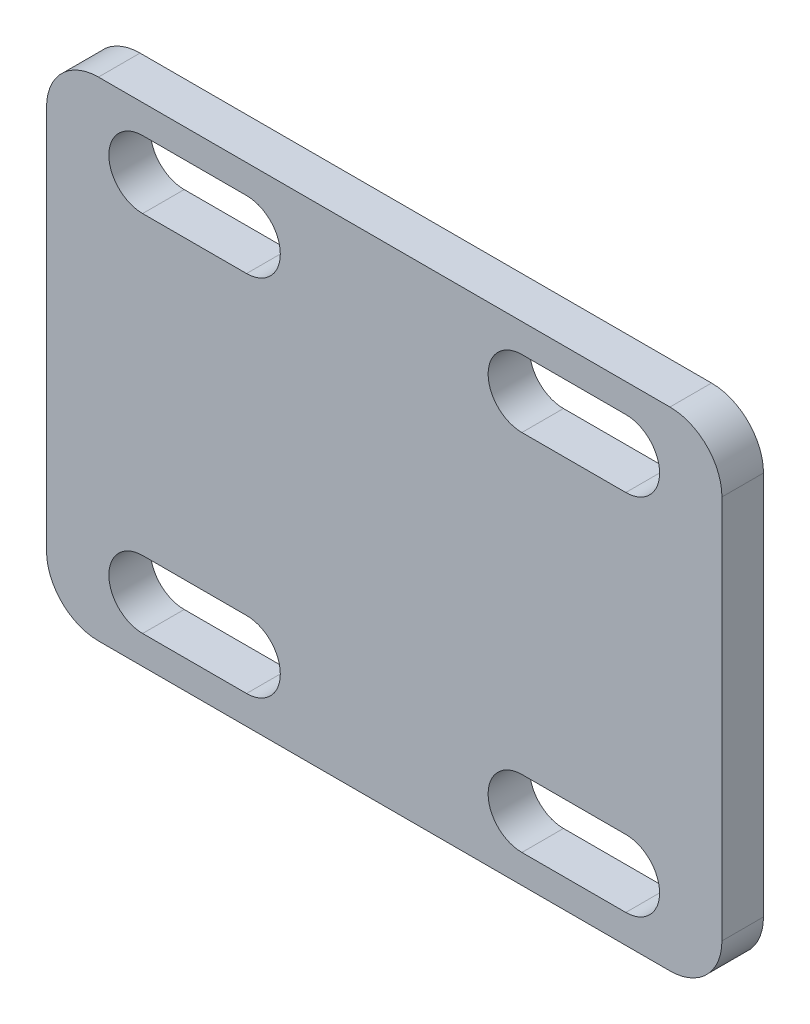
ISO-10303-21;
HEADER;
FILE_DESCRIPTION(('STEP AP214'),'2;1');
FILE_NAME('part.step','',(''),(''),'','','');
FILE_SCHEMA(('AUTOMOTIVE_DESIGN { 1 0 10303 214 1 1 1 1 }'));
ENDSEC;
DATA;
#1=APPLICATION_CONTEXT('core data for automotive mechanical design processes');
#2=APPLICATION_PROTOCOL_DEFINITION('international standard','automotive_design',2000,#1);
#3=PRODUCT_CONTEXT('',#1,'mechanical');
#4=PRODUCT('Part','Part','',(#3));
#5=PRODUCT_RELATED_PRODUCT_CATEGORY('part','',(#4));
#6=PRODUCT_DEFINITION_FORMATION('','',#4);
#7=PRODUCT_DEFINITION_CONTEXT('part definition',#1,'design');
#8=PRODUCT_DEFINITION('design','',#6,#7);
#9=PRODUCT_DEFINITION_SHAPE('','',#8);
#10=(LENGTH_UNIT() NAMED_UNIT(*) SI_UNIT(.MILLI.,.METRE.));
#11=(NAMED_UNIT(*) PLANE_ANGLE_UNIT() SI_UNIT($,.RADIAN.));
#12=(NAMED_UNIT(*) SI_UNIT($,.STERADIAN.) SOLID_ANGLE_UNIT());
#13=UNCERTAINTY_MEASURE_WITH_UNIT(LENGTH_MEASURE(1.E-05),#10,'distance_accuracy_value','');
#14=(GEOMETRIC_REPRESENTATION_CONTEXT(3) GLOBAL_UNCERTAINTY_ASSIGNED_CONTEXT((#13)) GLOBAL_UNIT_ASSIGNED_CONTEXT((#10,
#11,#12)) REPRESENTATION_CONTEXT('',''));
#15=CARTESIAN_POINT('',(0.,0.,0.));
#16=DIRECTION('',(0.,0.,1.));
#17=DIRECTION('',(1.,0.,0.));
#18=AXIS2_PLACEMENT_3D('',#15,#16,#17);
#19=CARTESIAN_POINT('',(0.,0.,8.));
#20=DIRECTION('',(0.,0.,-1.));
#21=DIRECTION('',(-1.,0.,0.));
#22=AXIS2_PLACEMENT_3D('',#19,#20,#21);
#23=PLANE('',#22);
#24=DIRECTION('',(1.,0.,0.));
#25=VECTOR('',#24,1.);
#26=CARTESIAN_POINT('',(-65.,-47.,8.));
#27=LINE('',#26,#25);
#28=CARTESIAN_POINT('',(-55.,-47.,8.));
#29=VERTEX_POINT('',#28);
#30=CARTESIAN_POINT('',(55.,-47.,8.));
#31=VERTEX_POINT('',#30);
#32=EDGE_CURVE('E401',#29,#31,#27,.T.);
#33=ORIENTED_EDGE('',*,*,#32,.T.);
#34=CARTESIAN_POINT('',(55.,-37.,8.));
#35=DIRECTION('',(0.,0.,-1.));
#36=DIRECTION('',(-1.,0.,0.));
#37=AXIS2_PLACEMENT_3D('',#34,#35,#36);
#38=CIRCLE('',#37,10.);
#39=CARTESIAN_POINT('',(65.,-37.,8.));
#40=VERTEX_POINT('',#39);
#41=EDGE_CURVE('E452',#31,#40,#38,.F.);
#42=ORIENTED_EDGE('',*,*,#41,.T.);
#43=DIRECTION('',(0.,1.,0.));
#44=VECTOR('',#43,1.);
#45=CARTESIAN_POINT('',(65.,-47.,8.));
#46=LINE('',#45,#44);
#47=CARTESIAN_POINT('',(65.,37.,8.));
#48=VERTEX_POINT('',#47);
#49=EDGE_CURVE('E390',#40,#48,#46,.T.);
#50=ORIENTED_EDGE('',*,*,#49,.T.);
#51=CARTESIAN_POINT('',(55.,37.,8.));
#52=DIRECTION('',(0.,0.,-1.));
#53=DIRECTION('',(-1.,0.,0.));
#54=AXIS2_PLACEMENT_3D('',#51,#52,#53);
#55=CIRCLE('',#54,10.);
#56=CARTESIAN_POINT('',(55.,47.,8.));
#57=VERTEX_POINT('',#56);
#58=EDGE_CURVE('E447',#48,#57,#55,.F.);
#59=ORIENTED_EDGE('',*,*,#58,.T.);
#60=DIRECTION('',(-1.,0.,0.));
#61=VECTOR('',#60,1.);
#62=CARTESIAN_POINT('',(-65.,47.,8.));
#63=LINE('',#62,#61);
#64=CARTESIAN_POINT('',(-55.,47.,8.));
#65=VERTEX_POINT('',#64);
#66=EDGE_CURVE('E394',#57,#65,#63,.T.);
#67=ORIENTED_EDGE('',*,*,#66,.T.);
#68=CARTESIAN_POINT('',(-55.,37.,8.));
#69=DIRECTION('',(0.,0.,-1.));
#70=DIRECTION('',(-1.,0.,0.));
#71=AXIS2_PLACEMENT_3D('',#68,#69,#70);
#72=CIRCLE('',#71,10.);
#73=CARTESIAN_POINT('',(-65.,37.,8.));
#74=VERTEX_POINT('',#73);
#75=EDGE_CURVE('E61',#65,#74,#72,.F.);
#76=ORIENTED_EDGE('',*,*,#75,.T.);
#77=DIRECTION('',(0.,-1.,0.));
#78=VECTOR('',#77,1.);
#79=CARTESIAN_POINT('',(-65.,-47.,8.));
#80=LINE('',#79,#78);
#81=CARTESIAN_POINT('',(-65.,-37.,8.));
#82=VERTEX_POINT('',#81);
#83=EDGE_CURVE('E398',#74,#82,#80,.T.);
#84=ORIENTED_EDGE('',*,*,#83,.T.);
#85=CARTESIAN_POINT('',(-55.,-37.,8.));
#86=DIRECTION('',(0.,0.,-1.));
#87=DIRECTION('',(-1.,0.,0.));
#88=AXIS2_PLACEMENT_3D('',#85,#86,#87);
#89=CIRCLE('',#88,10.);
#90=EDGE_CURVE('E444',#82,#29,#89,.F.);
#91=ORIENTED_EDGE('',*,*,#90,.T.);
#92=EDGE_LOOP('',(#33,#42,#50,#59,#67,#76,#84,#91));
#93=FACE_BOUND('',#92,.T.);
#94=DIRECTION('',(1.,0.,0.));
#95=VECTOR('',#94,1.);
#96=CARTESIAN_POINT('',(-46.5,28.5,8.));
#97=LINE('',#96,#95);
#98=CARTESIAN_POINT('',(-46.5,28.5,8.));
#99=VERTEX_POINT('',#98);
#100=CARTESIAN_POINT('',(-26.5,28.5,8.));
#101=VERTEX_POINT('',#100);
#102=EDGE_CURVE('E368',#99,#101,#97,.T.);
#103=ORIENTED_EDGE('',*,*,#102,.F.);
#104=CARTESIAN_POINT('',(-46.5,35.,8.));
#105=DIRECTION('',(0.,0.,1.));
#106=DIRECTION('',(1.,0.,0.));
#107=AXIS2_PLACEMENT_3D('',#104,#105,#106);
#108=CIRCLE('',#107,6.5);
#109=CARTESIAN_POINT('',(-46.5,41.5,8.));
#110=VERTEX_POINT('',#109);
#111=EDGE_CURVE('E279',#110,#99,#108,.T.);
#112=ORIENTED_EDGE('',*,*,#111,.F.);
#113=DIRECTION('',(-1.,0.,0.));
#114=VECTOR('',#113,1.);
#115=CARTESIAN_POINT('',(-46.5,41.5,8.));
#116=LINE('',#115,#114);
#117=CARTESIAN_POINT('',(-26.5,41.5,8.));
#118=VERTEX_POINT('',#117);
#119=EDGE_CURVE('E376',#118,#110,#116,.T.);
#120=ORIENTED_EDGE('',*,*,#119,.F.);
#121=CARTESIAN_POINT('',(-26.5,35.,8.));
#122=DIRECTION('',(0.,0.,1.));
#123=DIRECTION('',(1.,0.,0.));
#124=AXIS2_PLACEMENT_3D('',#121,#122,#123);
#125=CIRCLE('',#124,6.5);
#126=EDGE_CURVE('E372',#101,#118,#125,.T.);
#127=ORIENTED_EDGE('',*,*,#126,.F.);
#128=EDGE_LOOP('',(#103,#112,#120,#127));
#129=FACE_BOUND('',#128,.T.);
#130=CARTESIAN_POINT('',(-26.5,-35.,8.));
#131=DIRECTION('',(0.,0.,1.));
#132=DIRECTION('',(1.,0.,0.));
#133=AXIS2_PLACEMENT_3D('',#130,#131,#132);
#134=CIRCLE('',#133,6.5);
#135=CARTESIAN_POINT('',(-26.5,-41.5,8.));
#136=VERTEX_POINT('',#135);
#137=CARTESIAN_POINT('',(-26.5,-28.5,8.));
#138=VERTEX_POINT('',#137);
#139=EDGE_CURVE('E259',#136,#138,#134,.T.);
#140=ORIENTED_EDGE('',*,*,#139,.F.);
#141=DIRECTION('',(1.,0.,0.));
#142=VECTOR('',#141,1.);
#143=CARTESIAN_POINT('',(-46.5,-41.5,8.));
#144=LINE('',#143,#142);
#145=CARTESIAN_POINT('',(-46.5,-41.5,8.));
#146=VERTEX_POINT('',#145);
#147=EDGE_CURVE('E353',#146,#136,#144,.T.);
#148=ORIENTED_EDGE('',*,*,#147,.F.);
#149=CARTESIAN_POINT('',(-46.5,-35.,8.));
#150=DIRECTION('',(0.,0.,1.));
#151=DIRECTION('',(1.,0.,0.));
#152=AXIS2_PLACEMENT_3D('',#149,#150,#151);
#153=CIRCLE('',#152,6.5);
#154=CARTESIAN_POINT('',(-46.5,-28.5,8.));
#155=VERTEX_POINT('',#154);
#156=EDGE_CURVE('E343',#155,#146,#153,.T.);
#157=ORIENTED_EDGE('',*,*,#156,.F.);
#158=DIRECTION('',(-1.,0.,0.));
#159=VECTOR('',#158,1.);
#160=CARTESIAN_POINT('',(-46.5,-28.5,8.));
#161=LINE('',#160,#159);
#162=EDGE_CURVE('E347',#138,#155,#161,.T.);
#163=ORIENTED_EDGE('',*,*,#162,.F.);
#164=EDGE_LOOP('',(#140,#148,#157,#163));
#165=FACE_BOUND('',#164,.T.);
#166=CARTESIAN_POINT('',(46.5,-35.,8.));
#167=DIRECTION('',(0.,0.,1.));
#168=DIRECTION('',(1.,0.,0.));
#169=AXIS2_PLACEMENT_3D('',#166,#167,#168);
#170=CIRCLE('',#169,6.5);
#171=CARTESIAN_POINT('',(46.5,-41.5,8.));
#172=VERTEX_POINT('',#171);
#173=CARTESIAN_POINT('',(46.5,-28.5,8.));
#174=VERTEX_POINT('',#173);
#175=EDGE_CURVE('E243',#172,#174,#170,.T.);
#176=ORIENTED_EDGE('',*,*,#175,.F.);
#177=DIRECTION('',(1.,0.,0.));
#178=VECTOR('',#177,1.);
#179=CARTESIAN_POINT('',(26.5,-41.5,8.));
#180=LINE('',#179,#178);
#181=CARTESIAN_POINT('',(26.5,-41.5,8.));
#182=VERTEX_POINT('',#181);
#183=EDGE_CURVE('E326',#182,#172,#180,.T.);
#184=ORIENTED_EDGE('',*,*,#183,.F.);
#185=CARTESIAN_POINT('',(26.5,-35.,8.));
#186=DIRECTION('',(0.,0.,1.));
#187=DIRECTION('',(1.,0.,0.));
#188=AXIS2_PLACEMENT_3D('',#185,#186,#187);
#189=CIRCLE('',#188,6.5);
#190=CARTESIAN_POINT('',(26.5,-28.5,8.));
#191=VERTEX_POINT('',#190);
#192=EDGE_CURVE('E315',#191,#182,#189,.T.);
#193=ORIENTED_EDGE('',*,*,#192,.F.);
#194=DIRECTION('',(-1.,0.,0.));
#195=VECTOR('',#194,1.);
#196=CARTESIAN_POINT('',(26.5,-28.5,8.));
#197=LINE('',#196,#195);
#198=EDGE_CURVE('E319',#174,#191,#197,.T.);
#199=ORIENTED_EDGE('',*,*,#198,.F.);
#200=EDGE_LOOP('',(#176,#184,#193,#199));
#201=FACE_BOUND('',#200,.T.);
#202=CARTESIAN_POINT('',(46.5,35.,8.));
#203=DIRECTION('',(0.,0.,1.));
#204=DIRECTION('',(1.,0.,0.));
#205=AXIS2_PLACEMENT_3D('',#202,#203,#204);
#206=CIRCLE('',#205,6.5);
#207=CARTESIAN_POINT('',(46.5,28.5,8.));
#208=VERTEX_POINT('',#207);
#209=CARTESIAN_POINT('',(46.5,41.5,8.));
#210=VERTEX_POINT('',#209);
#211=EDGE_CURVE('E225',#208,#210,#206,.T.);
#212=ORIENTED_EDGE('',*,*,#211,.F.);
#213=DIRECTION('',(1.,0.,0.));
#214=VECTOR('',#213,1.);
#215=CARTESIAN_POINT('',(26.5,28.5,8.));
#216=LINE('',#215,#214);
#217=CARTESIAN_POINT('',(26.5,28.5,8.));
#218=VERTEX_POINT('',#217);
#219=EDGE_CURVE('E212',#218,#208,#216,.T.);
#220=ORIENTED_EDGE('',*,*,#219,.F.);
#221=CARTESIAN_POINT('',(26.5,35.,8.));
#222=DIRECTION('',(0.,0.,1.));
#223=DIRECTION('',(1.,0.,0.));
#224=AXIS2_PLACEMENT_3D('',#221,#222,#223);
#225=CIRCLE('',#224,6.5);
#226=CARTESIAN_POINT('',(26.5,41.5,8.));
#227=VERTEX_POINT('',#226);
#228=EDGE_CURVE('E294',#227,#218,#225,.T.);
#229=ORIENTED_EDGE('',*,*,#228,.F.);
#230=DIRECTION('',(-1.,0.,0.));
#231=VECTOR('',#230,1.);
#232=CARTESIAN_POINT('',(26.5,41.5,8.));
#233=LINE('',#232,#231);
#234=EDGE_CURVE('E298',#210,#227,#233,.T.);
#235=ORIENTED_EDGE('',*,*,#234,.F.);
#236=EDGE_LOOP('',(#212,#220,#229,#235));
#237=FACE_BOUND('',#236,.T.);
#238=ADVANCED_FACE('F38',(#93,#129,#165,#201,#237),#23,.F.);
#239=CARTESIAN_POINT('',(0.,0.,0.));
#240=DIRECTION('',(0.,0.,-1.));
#241=DIRECTION('',(-1.,0.,0.));
#242=AXIS2_PLACEMENT_3D('',#239,#240,#241);
#243=PLANE('',#242);
#244=DIRECTION('',(1.,0.,0.));
#245=VECTOR('',#244,1.);
#246=CARTESIAN_POINT('',(26.5,28.5,0.));
#247=LINE('',#246,#245);
#248=CARTESIAN_POINT('',(26.5,28.5,0.));
#249=VERTEX_POINT('',#248);
#250=CARTESIAN_POINT('',(46.5,28.5,0.));
#251=VERTEX_POINT('',#250);
#252=EDGE_CURVE('E201',#249,#251,#247,.T.);
#253=ORIENTED_EDGE('',*,*,#252,.T.);
#254=CARTESIAN_POINT('',(46.5,35.,0.));
#255=DIRECTION('',(0.,0.,-1.));
#256=DIRECTION('',(-1.,0.,0.));
#257=AXIS2_PLACEMENT_3D('',#254,#255,#256);
#258=CIRCLE('',#257,6.5);
#259=CARTESIAN_POINT('',(46.5,41.5,0.));
#260=VERTEX_POINT('',#259);
#261=EDGE_CURVE('E206',#251,#260,#258,.F.);
#262=ORIENTED_EDGE('',*,*,#261,.T.);
#263=DIRECTION('',(-1.,0.,0.));
#264=VECTOR('',#263,1.);
#265=CARTESIAN_POINT('',(26.5,41.5,0.));
#266=LINE('',#265,#264);
#267=CARTESIAN_POINT('',(26.5,41.5,0.));
#268=VERTEX_POINT('',#267);
#269=EDGE_CURVE('E289',#260,#268,#266,.T.);
#270=ORIENTED_EDGE('',*,*,#269,.T.);
#271=CARTESIAN_POINT('',(26.5,35.,0.));
#272=DIRECTION('',(0.,0.,-1.));
#273=DIRECTION('',(-1.,0.,0.));
#274=AXIS2_PLACEMENT_3D('',#271,#272,#273);
#275=CIRCLE('',#274,6.5);
#276=EDGE_CURVE('E207',#268,#249,#275,.F.);
#277=ORIENTED_EDGE('',*,*,#276,.T.);
#278=EDGE_LOOP('',(#253,#262,#270,#277));
#279=FACE_BOUND('',#278,.T.);
#280=DIRECTION('',(1.,0.,0.));
#281=VECTOR('',#280,1.);
#282=CARTESIAN_POINT('',(26.5,-41.5,0.));
#283=LINE('',#282,#281);
#284=CARTESIAN_POINT('',(26.5,-41.5,0.));
#285=VERTEX_POINT('',#284);
#286=CARTESIAN_POINT('',(46.5,-41.5,0.));
#287=VERTEX_POINT('',#286);
#288=EDGE_CURVE('E323',#285,#287,#283,.T.);
#289=ORIENTED_EDGE('',*,*,#288,.T.);
#290=CARTESIAN_POINT('',(46.5,-35.,0.));
#291=DIRECTION('',(0.,0.,-1.));
#292=DIRECTION('',(-1.,0.,0.));
#293=AXIS2_PLACEMENT_3D('',#290,#291,#292);
#294=CIRCLE('',#293,6.5);
#295=CARTESIAN_POINT('',(46.5,-28.5,0.));
#296=VERTEX_POINT('',#295);
#297=EDGE_CURVE('E239',#287,#296,#294,.F.);
#298=ORIENTED_EDGE('',*,*,#297,.T.);
#299=DIRECTION('',(-1.,0.,0.));
#300=VECTOR('',#299,1.);
#301=CARTESIAN_POINT('',(26.5,-28.5,0.));
#302=LINE('',#301,#300);
#303=CARTESIAN_POINT('',(26.5,-28.5,0.));
#304=VERTEX_POINT('',#303);
#305=EDGE_CURVE('E311',#296,#304,#302,.T.);
#306=ORIENTED_EDGE('',*,*,#305,.T.);
#307=CARTESIAN_POINT('',(26.5,-35.,0.));
#308=DIRECTION('',(0.,0.,-1.));
#309=DIRECTION('',(-1.,0.,0.));
#310=AXIS2_PLACEMENT_3D('',#307,#308,#309);
#311=CIRCLE('',#310,6.5);
#312=EDGE_CURVE('E312',#304,#285,#311,.F.);
#313=ORIENTED_EDGE('',*,*,#312,.T.);
#314=EDGE_LOOP('',(#289,#298,#306,#313));
#315=FACE_BOUND('',#314,.T.);
#316=DIRECTION('',(1.,0.,0.));
#317=VECTOR('',#316,1.);
#318=CARTESIAN_POINT('',(-46.5,-41.5,0.));
#319=LINE('',#318,#317);
#320=CARTESIAN_POINT('',(-46.5,-41.5,0.));
#321=VERTEX_POINT('',#320);
#322=CARTESIAN_POINT('',(-26.5,-41.5,0.));
#323=VERTEX_POINT('',#322);
#324=EDGE_CURVE('E234',#321,#323,#319,.T.);
#325=ORIENTED_EDGE('',*,*,#324,.T.);
#326=CARTESIAN_POINT('',(-26.5,-35.,0.));
#327=DIRECTION('',(0.,0.,-1.));
#328=DIRECTION('',(-1.,0.,0.));
#329=AXIS2_PLACEMENT_3D('',#326,#327,#328);
#330=CIRCLE('',#329,6.5);
#331=CARTESIAN_POINT('',(-26.5,-28.5,0.));
#332=VERTEX_POINT('',#331);
#333=EDGE_CURVE('E255',#323,#332,#330,.F.);
#334=ORIENTED_EDGE('',*,*,#333,.T.);
#335=DIRECTION('',(-1.,0.,0.));
#336=VECTOR('',#335,1.);
#337=CARTESIAN_POINT('',(-46.5,-28.5,0.));
#338=LINE('',#337,#336);
#339=CARTESIAN_POINT('',(-46.5,-28.5,0.));
#340=VERTEX_POINT('',#339);
#341=EDGE_CURVE('E339',#332,#340,#338,.T.);
#342=ORIENTED_EDGE('',*,*,#341,.T.);
#343=CARTESIAN_POINT('',(-46.5,-35.,0.));
#344=DIRECTION('',(0.,0.,-1.));
#345=DIRECTION('',(-1.,0.,0.));
#346=AXIS2_PLACEMENT_3D('',#343,#344,#345);
#347=CIRCLE('',#346,6.5);
#348=EDGE_CURVE('E340',#340,#321,#347,.F.);
#349=ORIENTED_EDGE('',*,*,#348,.T.);
#350=EDGE_LOOP('',(#325,#334,#342,#349));
#351=FACE_BOUND('',#350,.T.);
#352=CARTESIAN_POINT('',(-46.5,35.,0.));
#353=DIRECTION('',(0.,0.,-1.));
#354=DIRECTION('',(-1.,0.,0.));
#355=AXIS2_PLACEMENT_3D('',#352,#353,#354);
#356=CIRCLE('',#355,6.5);
#357=CARTESIAN_POINT('',(-46.5,41.5,0.));
#358=VERTEX_POINT('',#357);
#359=CARTESIAN_POINT('',(-46.5,28.5,0.));
#360=VERTEX_POINT('',#359);
#361=EDGE_CURVE('E275',#358,#360,#356,.F.);
#362=ORIENTED_EDGE('',*,*,#361,.T.);
#363=DIRECTION('',(1.,0.,0.));
#364=VECTOR('',#363,1.);
#365=CARTESIAN_POINT('',(-46.5,28.5,0.));
#366=LINE('',#365,#364);
#367=CARTESIAN_POINT('',(-26.5,28.5,0.));
#368=VERTEX_POINT('',#367);
#369=EDGE_CURVE('E383',#360,#368,#366,.T.);
#370=ORIENTED_EDGE('',*,*,#369,.T.);
#371=CARTESIAN_POINT('',(-26.5,35.,0.));
#372=DIRECTION('',(0.,0.,-1.));
#373=DIRECTION('',(-1.,0.,0.));
#374=AXIS2_PLACEMENT_3D('',#371,#372,#373);
#375=CIRCLE('',#374,6.5);
#376=CARTESIAN_POINT('',(-26.5,41.5,0.));
#377=VERTEX_POINT('',#376);
#378=EDGE_CURVE('E293',#368,#377,#375,.F.);
#379=ORIENTED_EDGE('',*,*,#378,.T.);
#380=DIRECTION('',(-1.,0.,0.));
#381=VECTOR('',#380,1.);
#382=CARTESIAN_POINT('',(-46.5,41.5,0.));
#383=LINE('',#382,#381);
#384=EDGE_CURVE('E365',#377,#358,#383,.T.);
#385=ORIENTED_EDGE('',*,*,#384,.T.);
#386=EDGE_LOOP('',(#362,#370,#379,#385));
#387=FACE_BOUND('',#386,.T.);
#388=DIRECTION('',(0.,1.,0.));
#389=VECTOR('',#388,1.);
#390=CARTESIAN_POINT('',(65.,-47.,0.));
#391=LINE('',#390,#389);
#392=CARTESIAN_POINT('',(65.,-37.,0.));
#393=VERTEX_POINT('',#392);
#394=CARTESIAN_POINT('',(65.,37.,0.));
#395=VERTEX_POINT('',#394);
#396=EDGE_CURVE('E389',#393,#395,#391,.T.);
#397=ORIENTED_EDGE('',*,*,#396,.F.);
#398=CARTESIAN_POINT('',(55.,-37.,0.));
#399=DIRECTION('',(0.,0.,-1.));
#400=DIRECTION('',(-1.,0.,0.));
#401=AXIS2_PLACEMENT_3D('',#398,#399,#400);
#402=CIRCLE('',#401,10.);
#403=CARTESIAN_POINT('',(55.,-47.,0.));
#404=VERTEX_POINT('',#403);
#405=EDGE_CURVE('E434',#393,#404,#402,.T.);
#406=ORIENTED_EDGE('',*,*,#405,.T.);
#407=DIRECTION('',(1.,0.,0.));
#408=VECTOR('',#407,1.);
#409=CARTESIAN_POINT('',(-65.,-47.,0.));
#410=LINE('',#409,#408);
#411=CARTESIAN_POINT('',(-55.,-47.,0.));
#412=VERTEX_POINT('',#411);
#413=EDGE_CURVE('E395',#412,#404,#410,.T.);
#414=ORIENTED_EDGE('',*,*,#413,.F.);
#415=CARTESIAN_POINT('',(-55.,-37.,0.));
#416=DIRECTION('',(0.,0.,-1.));
#417=DIRECTION('',(-1.,0.,0.));
#418=AXIS2_PLACEMENT_3D('',#415,#416,#417);
#419=CIRCLE('',#418,10.);
#420=CARTESIAN_POINT('',(-65.,-37.,0.));
#421=VERTEX_POINT('',#420);
#422=EDGE_CURVE('E425',#412,#421,#419,.T.);
#423=ORIENTED_EDGE('',*,*,#422,.T.);
#424=DIRECTION('',(0.,-1.,0.));
#425=VECTOR('',#424,1.);
#426=CARTESIAN_POINT('',(-65.,-47.,0.));
#427=LINE('',#426,#425);
#428=CARTESIAN_POINT('',(-65.,37.,0.));
#429=VERTEX_POINT('',#428);
#430=EDGE_CURVE('E413',#429,#421,#427,.T.);
#431=ORIENTED_EDGE('',*,*,#430,.F.);
#432=CARTESIAN_POINT('',(-55.,37.,0.));
#433=DIRECTION('',(0.,0.,-1.));
#434=DIRECTION('',(-1.,0.,0.));
#435=AXIS2_PLACEMENT_3D('',#432,#433,#434);
#436=CIRCLE('',#435,10.);
#437=CARTESIAN_POINT('',(-55.,47.,0.));
#438=VERTEX_POINT('',#437);
#439=EDGE_CURVE('E431',#429,#438,#436,.T.);
#440=ORIENTED_EDGE('',*,*,#439,.T.);
#441=DIRECTION('',(-1.,0.,0.));
#442=VECTOR('',#441,1.);
#443=CARTESIAN_POINT('',(-65.,47.,0.));
#444=LINE('',#443,#442);
#445=CARTESIAN_POINT('',(55.,47.,0.));
#446=VERTEX_POINT('',#445);
#447=EDGE_CURVE('E409',#446,#438,#444,.T.);
#448=ORIENTED_EDGE('',*,*,#447,.F.);
#449=CARTESIAN_POINT('',(55.,37.,0.));
#450=DIRECTION('',(0.,0.,-1.));
#451=DIRECTION('',(-1.,0.,0.));
#452=AXIS2_PLACEMENT_3D('',#449,#450,#451);
#453=CIRCLE('',#452,10.);
#454=EDGE_CURVE('E428',#446,#395,#453,.T.);
#455=ORIENTED_EDGE('',*,*,#454,.T.);
#456=EDGE_LOOP('',(#397,#406,#414,#423,#431,#440,#448,#455));
#457=FACE_BOUND('',#456,.T.);
#458=ADVANCED_FACE('F203',(#279,#315,#351,#387,#457),#243,.T.);
#459=CARTESIAN_POINT('',(65.,-47.,8.));
#460=DIRECTION('',(-1.,0.,0.));
#461=DIRECTION('',(0.,0.,1.));
#462=AXIS2_PLACEMENT_3D('',#459,#460,#461);
#463=PLANE('',#462);
#464=ORIENTED_EDGE('',*,*,#49,.F.);
#465=DIRECTION('',(0.,0.,-1.));
#466=VECTOR('',#465,1.);
#467=CARTESIAN_POINT('',(65.,-37.,8.));
#468=LINE('',#467,#466);
#469=EDGE_CURVE('E421',#40,#393,#468,.T.);
#470=ORIENTED_EDGE('',*,*,#469,.T.);
#471=ORIENTED_EDGE('',*,*,#396,.T.);
#472=DIRECTION('',(0.,0.,-1.));
#473=VECTOR('',#472,1.);
#474=CARTESIAN_POINT('',(65.,37.,8.));
#475=LINE('',#474,#473);
#476=EDGE_CURVE('E405',#395,#48,#475,.F.);
#477=ORIENTED_EDGE('',*,*,#476,.T.);
#478=EDGE_LOOP('',(#464,#470,#471,#477));
#479=FACE_BOUND('',#478,.T.);
#480=ADVANCED_FACE('F493',(#479),#463,.F.);
#481=CARTESIAN_POINT('',(-65.,47.,8.));
#482=DIRECTION('',(0.,-1.,0.));
#483=DIRECTION('',(0.,0.,-1.));
#484=AXIS2_PLACEMENT_3D('',#481,#482,#483);
#485=PLANE('',#484);
#486=ORIENTED_EDGE('',*,*,#447,.T.);
#487=DIRECTION('',(0.,0.,-1.));
#488=VECTOR('',#487,1.);
#489=CARTESIAN_POINT('',(-55.,47.,8.));
#490=LINE('',#489,#488);
#491=EDGE_CURVE('E11',#438,#65,#490,.F.);
#492=ORIENTED_EDGE('',*,*,#491,.T.);
#493=ORIENTED_EDGE('',*,*,#66,.F.);
#494=DIRECTION('',(0.,0.,-1.));
#495=VECTOR('',#494,1.);
#496=CARTESIAN_POINT('',(55.,47.,8.));
#497=LINE('',#496,#495);
#498=EDGE_CURVE('E47',#57,#446,#497,.T.);
#499=ORIENTED_EDGE('',*,*,#498,.T.);
#500=EDGE_LOOP('',(#486,#492,#493,#499));
#501=FACE_BOUND('',#500,.T.);
#502=ADVANCED_FACE('F467',(#501),#485,.F.);
#503=CARTESIAN_POINT('',(-65.,-47.,8.));
#504=DIRECTION('',(1.,0.,0.));
#505=DIRECTION('',(0.,0.,-1.));
#506=AXIS2_PLACEMENT_3D('',#503,#504,#505);
#507=PLANE('',#506);
#508=ORIENTED_EDGE('',*,*,#83,.F.);
#509=DIRECTION('',(0.,0.,-1.));
#510=VECTOR('',#509,1.);
#511=CARTESIAN_POINT('',(-65.,37.,8.));
#512=LINE('',#511,#510);
#513=EDGE_CURVE('E457',#74,#429,#512,.T.);
#514=ORIENTED_EDGE('',*,*,#513,.T.);
#515=ORIENTED_EDGE('',*,*,#430,.T.);
#516=DIRECTION('',(0.,0.,-1.));
#517=VECTOR('',#516,1.);
#518=CARTESIAN_POINT('',(-65.,-37.,8.));
#519=LINE('',#518,#517);
#520=EDGE_CURVE('E54',#421,#82,#519,.F.);
#521=ORIENTED_EDGE('',*,*,#520,.T.);
#522=EDGE_LOOP('',(#508,#514,#515,#521));
#523=FACE_BOUND('',#522,.T.);
#524=ADVANCED_FACE('F477',(#523),#507,.F.);
#525=CARTESIAN_POINT('',(-65.,-47.,8.));
#526=DIRECTION('',(0.,1.,0.));
#527=DIRECTION('',(0.,0.,1.));
#528=AXIS2_PLACEMENT_3D('',#525,#526,#527);
#529=PLANE('',#528);
#530=ORIENTED_EDGE('',*,*,#413,.T.);
#531=DIRECTION('',(0.,0.,-1.));
#532=VECTOR('',#531,1.);
#533=CARTESIAN_POINT('',(55.,-47.,8.));
#534=LINE('',#533,#532);
#535=EDGE_CURVE('E441',#404,#31,#534,.F.);
#536=ORIENTED_EDGE('',*,*,#535,.T.);
#537=ORIENTED_EDGE('',*,*,#32,.F.);
#538=DIRECTION('',(0.,0.,-1.));
#539=VECTOR('',#538,1.);
#540=CARTESIAN_POINT('',(-55.,-47.,8.));
#541=LINE('',#540,#539);
#542=EDGE_CURVE('E437',#29,#412,#541,.T.);
#543=ORIENTED_EDGE('',*,*,#542,.T.);
#544=EDGE_LOOP('',(#530,#536,#537,#543));
#545=FACE_BOUND('',#544,.T.);
#546=ADVANCED_FACE('F485',(#545),#529,.F.);
#547=CARTESIAN_POINT('',(55.,-37.,8.));
#548=DIRECTION('',(0.,0.,-1.));
#549=DIRECTION('',(-1.,0.,0.));
#550=AXIS2_PLACEMENT_3D('',#547,#548,#549);
#551=CYLINDRICAL_SURFACE('',#550,10.);
#552=ORIENTED_EDGE('',*,*,#41,.F.);
#553=ORIENTED_EDGE('',*,*,#535,.F.);
#554=ORIENTED_EDGE('',*,*,#405,.F.);
#555=ORIENTED_EDGE('',*,*,#469,.F.);
#556=EDGE_LOOP('',(#552,#553,#554,#555));
#557=FACE_BOUND('',#556,.T.);
#558=ADVANCED_FACE('F490',(#557),#551,.T.);
#559=CARTESIAN_POINT('',(-55.,37.,8.));
#560=DIRECTION('',(0.,0.,-1.));
#561=DIRECTION('',(-1.,0.,0.));
#562=AXIS2_PLACEMENT_3D('',#559,#560,#561);
#563=CYLINDRICAL_SURFACE('',#562,10.);
#564=ORIENTED_EDGE('',*,*,#75,.F.);
#565=ORIENTED_EDGE('',*,*,#491,.F.);
#566=ORIENTED_EDGE('',*,*,#439,.F.);
#567=ORIENTED_EDGE('',*,*,#513,.F.);
#568=EDGE_LOOP('',(#564,#565,#566,#567));
#569=FACE_BOUND('',#568,.T.);
#570=ADVANCED_FACE('F476',(#569),#563,.T.);
#571=CARTESIAN_POINT('',(55.,37.,8.));
#572=DIRECTION('',(0.,0.,-1.));
#573=DIRECTION('',(-1.,0.,0.));
#574=AXIS2_PLACEMENT_3D('',#571,#572,#573);
#575=CYLINDRICAL_SURFACE('',#574,10.);
#576=ORIENTED_EDGE('',*,*,#58,.F.);
#577=ORIENTED_EDGE('',*,*,#476,.F.);
#578=ORIENTED_EDGE('',*,*,#454,.F.);
#579=ORIENTED_EDGE('',*,*,#498,.F.);
#580=EDGE_LOOP('',(#576,#577,#578,#579));
#581=FACE_BOUND('',#580,.T.);
#582=ADVANCED_FACE('F495',(#581),#575,.T.);
#583=CARTESIAN_POINT('',(-55.,-37.,8.));
#584=DIRECTION('',(0.,0.,-1.));
#585=DIRECTION('',(-1.,0.,0.));
#586=AXIS2_PLACEMENT_3D('',#583,#584,#585);
#587=CYLINDRICAL_SURFACE('',#586,10.);
#588=ORIENTED_EDGE('',*,*,#90,.F.);
#589=ORIENTED_EDGE('',*,*,#520,.F.);
#590=ORIENTED_EDGE('',*,*,#422,.F.);
#591=ORIENTED_EDGE('',*,*,#542,.F.);
#592=EDGE_LOOP('',(#588,#589,#590,#591));
#593=FACE_BOUND('',#592,.T.);
#594=ADVANCED_FACE('F40',(#593),#587,.T.);
#595=CARTESIAN_POINT('',(26.5,28.5,-175.001));
#596=DIRECTION('',(0.,-1.,0.));
#597=DIRECTION('',(1.,0.,0.));
#598=AXIS2_PLACEMENT_3D('',#595,#596,#597);
#599=PLANE('',#598);
#600=DIRECTION('',(0.,0.,1.));
#601=VECTOR('',#600,1.);
#602=CARTESIAN_POINT('',(26.5,28.5,-175.001));
#603=LINE('',#602,#601);
#604=EDGE_CURVE('E286',#249,#218,#603,.T.);
#605=ORIENTED_EDGE('',*,*,#604,.T.);
#606=ORIENTED_EDGE('',*,*,#219,.T.);
#607=DIRECTION('',(0.,0.,1.));
#608=VECTOR('',#607,1.);
#609=CARTESIAN_POINT('',(46.5,28.5,-175.001));
#610=LINE('',#609,#608);
#611=EDGE_CURVE('E220',#251,#208,#610,.T.);
#612=ORIENTED_EDGE('',*,*,#611,.F.);
#613=ORIENTED_EDGE('',*,*,#252,.F.);
#614=EDGE_LOOP('',(#605,#606,#612,#613));
#615=FACE_BOUND('',#614,.T.);
#616=ADVANCED_FACE('F228',(#615),#599,.F.);
#617=CARTESIAN_POINT('',(26.5,35.,-175.001));
#618=DIRECTION('',(0.,0.,1.));
#619=DIRECTION('',(1.,0.,0.));
#620=AXIS2_PLACEMENT_3D('',#617,#618,#619);
#621=CYLINDRICAL_SURFACE('',#620,6.5);
#622=DIRECTION('',(0.,0.,1.));
#623=VECTOR('',#622,1.);
#624=CARTESIAN_POINT('',(26.5,41.5,-175.001));
#625=LINE('',#624,#623);
#626=EDGE_CURVE('E290',#268,#227,#625,.T.);
#627=ORIENTED_EDGE('',*,*,#626,.T.);
#628=ORIENTED_EDGE('',*,*,#228,.T.);
#629=ORIENTED_EDGE('',*,*,#604,.F.);
#630=ORIENTED_EDGE('',*,*,#276,.F.);
#631=EDGE_LOOP('',(#627,#628,#629,#630));
#632=FACE_BOUND('',#631,.T.);
#633=ADVANCED_FACE('F554',(#632),#621,.F.);
#634=CARTESIAN_POINT('',(26.5,41.5,-175.001));
#635=DIRECTION('',(0.,1.,0.));
#636=DIRECTION('',(-1.,0.,0.));
#637=AXIS2_PLACEMENT_3D('',#634,#635,#636);
#638=PLANE('',#637);
#639=ORIENTED_EDGE('',*,*,#269,.F.);
#640=DIRECTION('',(0.,0.,1.));
#641=VECTOR('',#640,1.);
#642=CARTESIAN_POINT('',(46.5,41.5,-175.001));
#643=LINE('',#642,#641);
#644=EDGE_CURVE('E223',#260,#210,#643,.T.);
#645=ORIENTED_EDGE('',*,*,#644,.T.);
#646=ORIENTED_EDGE('',*,*,#234,.T.);
#647=ORIENTED_EDGE('',*,*,#626,.F.);
#648=EDGE_LOOP('',(#639,#645,#646,#647));
#649=FACE_BOUND('',#648,.T.);
#650=ADVANCED_FACE('F567',(#649),#638,.F.);
#651=CARTESIAN_POINT('',(26.5,-41.5,-175.001));
#652=DIRECTION('',(0.,-1.,0.));
#653=DIRECTION('',(1.,0.,0.));
#654=AXIS2_PLACEMENT_3D('',#651,#652,#653);
#655=PLANE('',#654);
#656=DIRECTION('',(0.,0.,1.));
#657=VECTOR('',#656,1.);
#658=CARTESIAN_POINT('',(26.5,-41.5,-175.001));
#659=LINE('',#658,#657);
#660=EDGE_CURVE('E308',#285,#182,#659,.T.);
#661=ORIENTED_EDGE('',*,*,#660,.T.);
#662=ORIENTED_EDGE('',*,*,#183,.T.);
#663=DIRECTION('',(0.,0.,1.));
#664=VECTOR('',#663,1.);
#665=CARTESIAN_POINT('',(46.5,-41.5,-175.001));
#666=LINE('',#665,#664);
#667=EDGE_CURVE('E248',#287,#172,#666,.T.);
#668=ORIENTED_EDGE('',*,*,#667,.F.);
#669=ORIENTED_EDGE('',*,*,#288,.F.);
#670=EDGE_LOOP('',(#661,#662,#668,#669));
#671=FACE_BOUND('',#670,.T.);
#672=ADVANCED_FACE('F578',(#671),#655,.F.);
#673=CARTESIAN_POINT('',(26.5,-35.,-175.001));
#674=DIRECTION('',(0.,0.,1.));
#675=DIRECTION('',(1.,0.,0.));
#676=AXIS2_PLACEMENT_3D('',#673,#674,#675);
#677=CYLINDRICAL_SURFACE('',#676,6.5);
#678=DIRECTION('',(0.,0.,1.));
#679=VECTOR('',#678,1.);
#680=CARTESIAN_POINT('',(26.5,-28.5,-175.001));
#681=LINE('',#680,#679);
#682=EDGE_CURVE('E213',#304,#191,#681,.T.);
#683=ORIENTED_EDGE('',*,*,#682,.T.);
#684=ORIENTED_EDGE('',*,*,#192,.T.);
#685=ORIENTED_EDGE('',*,*,#660,.F.);
#686=ORIENTED_EDGE('',*,*,#312,.F.);
#687=EDGE_LOOP('',(#683,#684,#685,#686));
#688=FACE_BOUND('',#687,.T.);
#689=ADVANCED_FACE('F592',(#688),#677,.F.);
#690=CARTESIAN_POINT('',(26.5,-28.5,-175.001));
#691=DIRECTION('',(0.,1.,0.));
#692=DIRECTION('',(-1.,0.,0.));
#693=AXIS2_PLACEMENT_3D('',#690,#691,#692);
#694=PLANE('',#693);
#695=ORIENTED_EDGE('',*,*,#305,.F.);
#696=DIRECTION('',(0.,0.,1.));
#697=VECTOR('',#696,1.);
#698=CARTESIAN_POINT('',(46.5,-28.5,-175.001));
#699=LINE('',#698,#697);
#700=EDGE_CURVE('E226',#296,#174,#699,.T.);
#701=ORIENTED_EDGE('',*,*,#700,.T.);
#702=ORIENTED_EDGE('',*,*,#198,.T.);
#703=ORIENTED_EDGE('',*,*,#682,.F.);
#704=EDGE_LOOP('',(#695,#701,#702,#703));
#705=FACE_BOUND('',#704,.T.);
#706=ADVANCED_FACE('F606',(#705),#694,.F.);
#707=CARTESIAN_POINT('',(-46.5,-41.5,-175.001));
#708=DIRECTION('',(0.,-1.,0.));
#709=DIRECTION('',(1.,0.,0.));
#710=AXIS2_PLACEMENT_3D('',#707,#708,#709);
#711=PLANE('',#710);
#712=DIRECTION('',(0.,0.,1.));
#713=VECTOR('',#712,1.);
#714=CARTESIAN_POINT('',(-46.5,-41.5,-175.001));
#715=LINE('',#714,#713);
#716=EDGE_CURVE('E336',#321,#146,#715,.T.);
#717=ORIENTED_EDGE('',*,*,#716,.T.);
#718=ORIENTED_EDGE('',*,*,#147,.T.);
#719=DIRECTION('',(0.,0.,1.));
#720=VECTOR('',#719,1.);
#721=CARTESIAN_POINT('',(-26.5,-41.5,-175.001));
#722=LINE('',#721,#720);
#723=EDGE_CURVE('E264',#323,#136,#722,.T.);
#724=ORIENTED_EDGE('',*,*,#723,.F.);
#725=ORIENTED_EDGE('',*,*,#324,.F.);
#726=EDGE_LOOP('',(#717,#718,#724,#725));
#727=FACE_BOUND('',#726,.T.);
#728=ADVANCED_FACE('F617',(#727),#711,.F.);
#729=CARTESIAN_POINT('',(-46.5,-35.,-175.001));
#730=DIRECTION('',(0.,0.,1.));
#731=DIRECTION('',(1.,0.,0.));
#732=AXIS2_PLACEMENT_3D('',#729,#730,#731);
#733=CYLINDRICAL_SURFACE('',#732,6.5);
#734=DIRECTION('',(0.,0.,1.));
#735=VECTOR('',#734,1.);
#736=CARTESIAN_POINT('',(-46.5,-28.5,-175.001));
#737=LINE('',#736,#735);
#738=EDGE_CURVE('E327',#340,#155,#737,.T.);
#739=ORIENTED_EDGE('',*,*,#738,.T.);
#740=ORIENTED_EDGE('',*,*,#156,.T.);
#741=ORIENTED_EDGE('',*,*,#716,.F.);
#742=ORIENTED_EDGE('',*,*,#348,.F.);
#743=EDGE_LOOP('',(#739,#740,#741,#742));
#744=FACE_BOUND('',#743,.T.);
#745=ADVANCED_FACE('F631',(#744),#733,.F.);
#746=CARTESIAN_POINT('',(-46.5,-28.5,-175.001));
#747=DIRECTION('',(0.,1.,0.));
#748=DIRECTION('',(-1.,0.,0.));
#749=AXIS2_PLACEMENT_3D('',#746,#747,#748);
#750=PLANE('',#749);
#751=ORIENTED_EDGE('',*,*,#341,.F.);
#752=DIRECTION('',(0.,0.,1.));
#753=VECTOR('',#752,1.);
#754=CARTESIAN_POINT('',(-26.5,-28.5,-175.001));
#755=LINE('',#754,#753);
#756=EDGE_CURVE('E244',#332,#138,#755,.T.);
#757=ORIENTED_EDGE('',*,*,#756,.T.);
#758=ORIENTED_EDGE('',*,*,#162,.T.);
#759=ORIENTED_EDGE('',*,*,#738,.F.);
#760=EDGE_LOOP('',(#751,#757,#758,#759));
#761=FACE_BOUND('',#760,.T.);
#762=ADVANCED_FACE('F645',(#761),#750,.F.);
#763=CARTESIAN_POINT('',(-46.5,28.5,-175.001));
#764=DIRECTION('',(0.,-1.,0.));
#765=DIRECTION('',(1.,0.,0.));
#766=AXIS2_PLACEMENT_3D('',#763,#764,#765);
#767=PLANE('',#766);
#768=ORIENTED_EDGE('',*,*,#369,.F.);
#769=DIRECTION('',(0.,0.,1.));
#770=VECTOR('',#769,1.);
#771=CARTESIAN_POINT('',(-46.5,28.5,-175.001));
#772=LINE('',#771,#770);
#773=EDGE_CURVE('E271',#360,#99,#772,.T.);
#774=ORIENTED_EDGE('',*,*,#773,.T.);
#775=ORIENTED_EDGE('',*,*,#102,.T.);
#776=DIRECTION('',(0.,0.,1.));
#777=VECTOR('',#776,1.);
#778=CARTESIAN_POINT('',(-26.5,28.5,-175.001));
#779=LINE('',#778,#777);
#780=EDGE_CURVE('E379',#368,#101,#779,.T.);
#781=ORIENTED_EDGE('',*,*,#780,.F.);
#782=EDGE_LOOP('',(#768,#774,#775,#781));
#783=FACE_BOUND('',#782,.T.);
#784=ADVANCED_FACE('F509',(#783),#767,.F.);
#785=CARTESIAN_POINT('',(-26.5,35.,-175.001));
#786=DIRECTION('',(0.,0.,1.));
#787=DIRECTION('',(1.,0.,0.));
#788=AXIS2_PLACEMENT_3D('',#785,#786,#787);
#789=CYLINDRICAL_SURFACE('',#788,6.5);
#790=ORIENTED_EDGE('',*,*,#780,.T.);
#791=ORIENTED_EDGE('',*,*,#126,.T.);
#792=DIRECTION('',(0.,0.,1.));
#793=VECTOR('',#792,1.);
#794=CARTESIAN_POINT('',(-26.5,41.5,-175.001));
#795=LINE('',#794,#793);
#796=EDGE_CURVE('E380',#377,#118,#795,.T.);
#797=ORIENTED_EDGE('',*,*,#796,.F.);
#798=ORIENTED_EDGE('',*,*,#378,.F.);
#799=EDGE_LOOP('',(#790,#791,#797,#798));
#800=FACE_BOUND('',#799,.T.);
#801=ADVANCED_FACE('F669',(#800),#789,.F.);
#802=CARTESIAN_POINT('',(-46.5,41.5,-175.001));
#803=DIRECTION('',(0.,1.,0.));
#804=DIRECTION('',(-1.,0.,0.));
#805=AXIS2_PLACEMENT_3D('',#802,#803,#804);
#806=PLANE('',#805);
#807=ORIENTED_EDGE('',*,*,#796,.T.);
#808=ORIENTED_EDGE('',*,*,#119,.T.);
#809=DIRECTION('',(0.,0.,1.));
#810=VECTOR('',#809,1.);
#811=CARTESIAN_POINT('',(-46.5,41.5,-175.001));
#812=LINE('',#811,#810);
#813=EDGE_CURVE('E260',#358,#110,#812,.T.);
#814=ORIENTED_EDGE('',*,*,#813,.F.);
#815=ORIENTED_EDGE('',*,*,#384,.F.);
#816=EDGE_LOOP('',(#807,#808,#814,#815));
#817=FACE_BOUND('',#816,.T.);
#818=ADVANCED_FACE('F682',(#817),#806,.F.);
#819=CARTESIAN_POINT('',(-46.5,35.,-175.001));
#820=DIRECTION('',(0.,0.,1.));
#821=DIRECTION('',(1.,0.,0.));
#822=AXIS2_PLACEMENT_3D('',#819,#820,#821);
#823=CYLINDRICAL_SURFACE('',#822,6.5);
#824=ORIENTED_EDGE('',*,*,#813,.T.);
#825=ORIENTED_EDGE('',*,*,#111,.T.);
#826=ORIENTED_EDGE('',*,*,#773,.F.);
#827=ORIENTED_EDGE('',*,*,#361,.F.);
#828=EDGE_LOOP('',(#824,#825,#826,#827));
#829=FACE_BOUND('',#828,.T.);
#830=ADVANCED_FACE('F692',(#829),#823,.F.);
#831=CARTESIAN_POINT('',(-26.5,-35.,-175.001));
#832=DIRECTION('',(0.,0.,1.));
#833=DIRECTION('',(1.,0.,0.));
#834=AXIS2_PLACEMENT_3D('',#831,#832,#833);
#835=CYLINDRICAL_SURFACE('',#834,6.5);
#836=ORIENTED_EDGE('',*,*,#723,.T.);
#837=ORIENTED_EDGE('',*,*,#139,.T.);
#838=ORIENTED_EDGE('',*,*,#756,.F.);
#839=ORIENTED_EDGE('',*,*,#333,.F.);
#840=EDGE_LOOP('',(#836,#837,#838,#839));
#841=FACE_BOUND('',#840,.T.);
#842=ADVANCED_FACE('F706',(#841),#835,.F.);
#843=CARTESIAN_POINT('',(46.5,-35.,-175.001));
#844=DIRECTION('',(0.,0.,1.));
#845=DIRECTION('',(1.,0.,0.));
#846=AXIS2_PLACEMENT_3D('',#843,#844,#845);
#847=CYLINDRICAL_SURFACE('',#846,6.5);
#848=ORIENTED_EDGE('',*,*,#667,.T.);
#849=ORIENTED_EDGE('',*,*,#175,.T.);
#850=ORIENTED_EDGE('',*,*,#700,.F.);
#851=ORIENTED_EDGE('',*,*,#297,.F.);
#852=EDGE_LOOP('',(#848,#849,#850,#851));
#853=FACE_BOUND('',#852,.T.);
#854=ADVANCED_FACE('F717',(#853),#847,.F.);
#855=CARTESIAN_POINT('',(46.5,35.,-175.001));
#856=DIRECTION('',(0.,0.,1.));
#857=DIRECTION('',(1.,0.,0.));
#858=AXIS2_PLACEMENT_3D('',#855,#856,#857);
#859=CYLINDRICAL_SURFACE('',#858,6.5);
#860=ORIENTED_EDGE('',*,*,#611,.T.);
#861=ORIENTED_EDGE('',*,*,#211,.T.);
#862=ORIENTED_EDGE('',*,*,#644,.F.);
#863=ORIENTED_EDGE('',*,*,#261,.F.);
#864=EDGE_LOOP('',(#860,#861,#862,#863));
#865=FACE_BOUND('',#864,.T.);
#866=ADVANCED_FACE('F218',(#865),#859,.F.);
#867=CLOSED_SHELL('',(#238,#458,#480,#502,#524,#546,#558,#570,#582,#594,#616,#633,#650,#672,
#689,#706,#728,#745,#762,#784,#801,#818,#830,#842,#854,#866));
#868=MANIFOLD_SOLID_BREP('B2',#867);
#869=ADVANCED_BREP_SHAPE_REPRESENTATION('',(#18,#868),#14);
#870=SHAPE_DEFINITION_REPRESENTATION(#9,#869);
ENDSEC;
END-ISO-10303-21;
